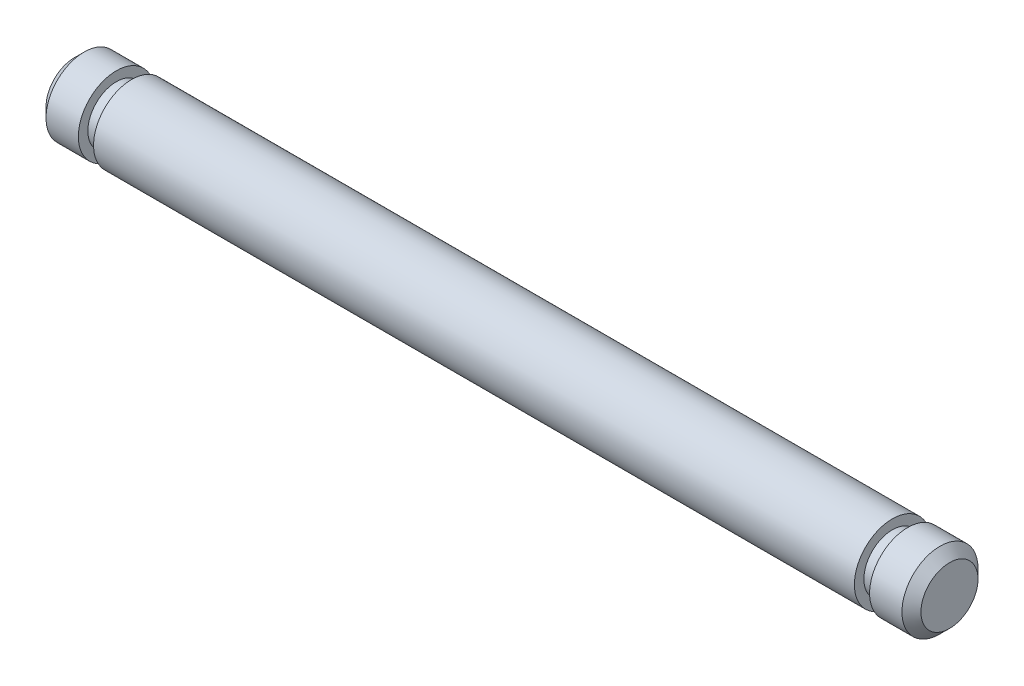
ISO-10303-21;
HEADER;
FILE_DESCRIPTION(('STEP AP214'),'2;1');
FILE_NAME('part.step','',(''),(''),'','','');
FILE_SCHEMA(('AUTOMOTIVE_DESIGN { 1 0 10303 214 1 1 1 1 }'));
ENDSEC;
DATA;
#1=APPLICATION_CONTEXT('core data for automotive mechanical design processes');
#2=APPLICATION_PROTOCOL_DEFINITION('international standard','automotive_design',2000,#1);
#3=PRODUCT_CONTEXT('',#1,'mechanical');
#4=PRODUCT('Part','Part','',(#3));
#5=PRODUCT_RELATED_PRODUCT_CATEGORY('part','',(#4));
#6=PRODUCT_DEFINITION_FORMATION('','',#4);
#7=PRODUCT_DEFINITION_CONTEXT('part definition',#1,'design');
#8=PRODUCT_DEFINITION('design','',#6,#7);
#9=PRODUCT_DEFINITION_SHAPE('','',#8);
#10=(LENGTH_UNIT() NAMED_UNIT(*) SI_UNIT(.MILLI.,.METRE.));
#11=(NAMED_UNIT(*) PLANE_ANGLE_UNIT() SI_UNIT($,.RADIAN.));
#12=(NAMED_UNIT(*) SI_UNIT($,.STERADIAN.) SOLID_ANGLE_UNIT());
#13=UNCERTAINTY_MEASURE_WITH_UNIT(LENGTH_MEASURE(1.E-05),#10,'distance_accuracy_value','');
#14=(GEOMETRIC_REPRESENTATION_CONTEXT(3) GLOBAL_UNCERTAINTY_ASSIGNED_CONTEXT((#13)) GLOBAL_UNIT_ASSIGNED_CONTEXT((#10,
#11,#12)) REPRESENTATION_CONTEXT('',''));
#15=CARTESIAN_POINT('',(0.,0.,0.));
#16=DIRECTION('',(0.,0.,1.));
#17=DIRECTION('',(1.,0.,0.));
#18=AXIS2_PLACEMENT_3D('',#15,#16,#17);
#19=CARTESIAN_POINT('',(23.,0.,0.));
#20=DIRECTION('',(-1.,0.,0.));
#21=DIRECTION('',(0.,0.,1.));
#22=AXIS2_PLACEMENT_3D('',#19,#20,#21);
#23=CYLINDRICAL_SURFACE('',#22,2.);
#24=CARTESIAN_POINT('',(20.,0.,0.));
#25=DIRECTION('',(1.,0.,0.));
#26=DIRECTION('',(0.,0.,-1.));
#27=AXIS2_PLACEMENT_3D('',#24,#25,#26);
#28=CIRCLE('',#27,2.);
#29=CARTESIAN_POINT('',(20.,0.,-2.));
#30=VERTEX_POINT('',#29);
#31=EDGE_CURVE('E62',#30,#30,#28,.T.);
#32=ORIENTED_EDGE('',*,*,#31,.F.);
#33=EDGE_LOOP('',(#32));
#34=FACE_BOUND('',#33,.T.);
#35=CARTESIAN_POINT('',(-20.,0.,0.));
#36=DIRECTION('',(1.,0.,0.));
#37=DIRECTION('',(0.,0.,-1.));
#38=AXIS2_PLACEMENT_3D('',#35,#36,#37);
#39=CIRCLE('',#38,2.);
#40=CARTESIAN_POINT('',(-20.,0.,-2.));
#41=VERTEX_POINT('',#40);
#42=EDGE_CURVE('E78',#41,#41,#39,.T.);
#43=ORIENTED_EDGE('',*,*,#42,.T.);
#44=EDGE_LOOP('',(#43));
#45=FACE_BOUND('',#44,.T.);
#46=ADVANCED_FACE('F37',(#34,#45),#23,.T.);
#47=CARTESIAN_POINT('',(20.8,0.,0.));
#48=DIRECTION('',(1.,0.,0.));
#49=DIRECTION('',(0.,0.,-1.));
#50=AXIS2_PLACEMENT_3D('',#47,#48,#49);
#51=CIRCLE('',#50,2.);
#52=CARTESIAN_POINT('',(20.8,0.,-2.));
#53=VERTEX_POINT('',#52);
#54=EDGE_CURVE('E61',#53,#53,#51,.T.);
#55=ORIENTED_EDGE('',*,*,#54,.T.);
#56=EDGE_LOOP('',(#55));
#57=FACE_BOUND('',#56,.T.);
#58=CARTESIAN_POINT('',(22.5,0.,0.));
#59=DIRECTION('',(1.,0.,0.));
#60=DIRECTION('',(0.,0.,-1.));
#61=AXIS2_PLACEMENT_3D('',#58,#59,#60);
#62=CIRCLE('',#61,2.);
#63=CARTESIAN_POINT('',(22.5,0.,-2.));
#64=VERTEX_POINT('',#63);
#65=EDGE_CURVE('E45',#64,#64,#62,.F.);
#66=ORIENTED_EDGE('',*,*,#65,.T.);
#67=EDGE_LOOP('',(#66));
#68=FACE_BOUND('',#67,.T.);
#69=ADVANCED_FACE('F109',(#57,#68),#23,.T.);
#70=CARTESIAN_POINT('',(23.,0.,0.));
#71=DIRECTION('',(1.,0.,0.));
#72=DIRECTION('',(0.,0.,-1.));
#73=AXIS2_PLACEMENT_3D('',#70,#71,#72);
#74=PLANE('',#73);
#75=CARTESIAN_POINT('',(23.,0.,0.));
#76=DIRECTION('',(1.,0.,0.));
#77=DIRECTION('',(0.,0.,-1.));
#78=AXIS2_PLACEMENT_3D('',#75,#76,#77);
#79=CIRCLE('',#78,1.49999999999999);
#80=CARTESIAN_POINT('',(23.,0.,-1.49999999999999));
#81=VERTEX_POINT('',#80);
#82=EDGE_CURVE('E55',#81,#81,#79,.T.);
#83=ORIENTED_EDGE('',*,*,#82,.T.);
#84=EDGE_LOOP('',(#83));
#85=FACE_BOUND('',#84,.T.);
#86=ADVANCED_FACE('F124',(#85),#74,.T.);
#87=CARTESIAN_POINT('',(23.,0.,0.));
#88=DIRECTION('',(-1.,0.,0.));
#89=DIRECTION('',(0.,0.,1.));
#90=AXIS2_PLACEMENT_3D('',#87,#88,#89);
#91=CONICAL_SURFACE('',#90,1.49999999999999,0.785398163397453);
#92=ORIENTED_EDGE('',*,*,#65,.F.);
#93=EDGE_LOOP('',(#92));
#94=FACE_BOUND('',#93,.T.);
#95=ORIENTED_EDGE('',*,*,#82,.F.);
#96=EDGE_LOOP('',(#95));
#97=FACE_BOUND('',#96,.T.);
#98=ADVANCED_FACE('F129',(#94,#97),#91,.T.);
#99=CARTESIAN_POINT('',(20.8,0.,0.));
#100=DIRECTION('',(1.,0.,0.));
#101=DIRECTION('',(0.,0.,-1.));
#102=AXIS2_PLACEMENT_3D('',#99,#100,#101);
#103=PLANE('',#102);
#104=ORIENTED_EDGE('',*,*,#54,.F.);
#105=EDGE_LOOP('',(#104));
#106=FACE_BOUND('',#105,.T.);
#107=CARTESIAN_POINT('',(20.8,0.,0.));
#108=DIRECTION('',(1.,0.,0.));
#109=DIRECTION('',(0.,0.,-1.));
#110=AXIS2_PLACEMENT_3D('',#107,#108,#109);
#111=CIRCLE('',#110,1.5);
#112=CARTESIAN_POINT('',(20.8,0.,-1.5));
#113=VERTEX_POINT('',#112);
#114=EDGE_CURVE('E66',#113,#113,#111,.T.);
#115=ORIENTED_EDGE('',*,*,#114,.T.);
#116=EDGE_LOOP('',(#115));
#117=FACE_BOUND('',#116,.T.);
#118=ADVANCED_FACE('F131',(#106,#117),#103,.F.);
#119=CARTESIAN_POINT('',(20.,0.,0.));
#120=DIRECTION('',(1.,0.,0.));
#121=DIRECTION('',(0.,0.,-1.));
#122=AXIS2_PLACEMENT_3D('',#119,#120,#121);
#123=PLANE('',#122);
#124=ORIENTED_EDGE('',*,*,#31,.T.);
#125=EDGE_LOOP('',(#124));
#126=FACE_BOUND('',#125,.T.);
#127=CARTESIAN_POINT('',(20.,0.,0.));
#128=DIRECTION('',(1.,0.,0.));
#129=DIRECTION('',(0.,0.,-1.));
#130=AXIS2_PLACEMENT_3D('',#127,#128,#129);
#131=CIRCLE('',#130,1.5);
#132=CARTESIAN_POINT('',(20.,0.,-1.5));
#133=VERTEX_POINT('',#132);
#134=EDGE_CURVE('E70',#133,#133,#131,.T.);
#135=ORIENTED_EDGE('',*,*,#134,.F.);
#136=EDGE_LOOP('',(#135));
#137=FACE_BOUND('',#136,.T.);
#138=ADVANCED_FACE('F137',(#126,#137),#123,.T.);
#139=CARTESIAN_POINT('',(20.8,0.,0.));
#140=DIRECTION('',(-1.,0.,0.));
#141=DIRECTION('',(0.,0.,1.));
#142=AXIS2_PLACEMENT_3D('',#139,#140,#141);
#143=CYLINDRICAL_SURFACE('',#142,1.5);
#144=ORIENTED_EDGE('',*,*,#114,.F.);
#145=EDGE_LOOP('',(#144));
#146=FACE_BOUND('',#145,.T.);
#147=ORIENTED_EDGE('',*,*,#134,.T.);
#148=EDGE_LOOP('',(#147));
#149=FACE_BOUND('',#148,.T.);
#150=ADVANCED_FACE('F101',(#146,#149),#143,.T.);
#151=CARTESIAN_POINT('',(-20.8,0.,0.));
#152=DIRECTION('',(-1.,0.,0.));
#153=DIRECTION('',(0.,0.,-1.));
#154=AXIS2_PLACEMENT_3D('',#151,#152,#153);
#155=PLANE('',#154);
#156=CARTESIAN_POINT('',(-20.8,0.,0.));
#157=DIRECTION('',(1.,0.,0.));
#158=DIRECTION('',(0.,0.,-1.));
#159=AXIS2_PLACEMENT_3D('',#156,#157,#158);
#160=CIRCLE('',#159,1.5);
#161=CARTESIAN_POINT('',(-20.8,0.,-1.5));
#162=VERTEX_POINT('',#161);
#163=EDGE_CURVE('E82',#162,#162,#160,.T.);
#164=ORIENTED_EDGE('',*,*,#163,.F.);
#165=EDGE_LOOP('',(#164));
#166=FACE_BOUND('',#165,.T.);
#167=CARTESIAN_POINT('',(-20.8,0.,0.));
#168=DIRECTION('',(1.,0.,0.));
#169=DIRECTION('',(0.,0.,-1.));
#170=AXIS2_PLACEMENT_3D('',#167,#168,#169);
#171=CIRCLE('',#170,2.);
#172=CARTESIAN_POINT('',(-20.8,0.,-2.));
#173=VERTEX_POINT('',#172);
#174=EDGE_CURVE('E74',#173,#173,#171,.T.);
#175=ORIENTED_EDGE('',*,*,#174,.T.);
#176=EDGE_LOOP('',(#175));
#177=FACE_BOUND('',#176,.T.);
#178=ADVANCED_FACE('F97',(#166,#177),#155,.F.);
#179=CARTESIAN_POINT('',(-20.,0.,0.));
#180=DIRECTION('',(-1.,0.,0.));
#181=DIRECTION('',(0.,0.,-1.));
#182=AXIS2_PLACEMENT_3D('',#179,#180,#181);
#183=PLANE('',#182);
#184=CARTESIAN_POINT('',(-20.,0.,0.));
#185=DIRECTION('',(1.,0.,0.));
#186=DIRECTION('',(0.,0.,-1.));
#187=AXIS2_PLACEMENT_3D('',#184,#185,#186);
#188=CIRCLE('',#187,1.5);
#189=CARTESIAN_POINT('',(-20.,0.,-1.5));
#190=VERTEX_POINT('',#189);
#191=EDGE_CURVE('E86',#190,#190,#188,.T.);
#192=ORIENTED_EDGE('',*,*,#191,.T.);
#193=EDGE_LOOP('',(#192));
#194=FACE_BOUND('',#193,.T.);
#195=ORIENTED_EDGE('',*,*,#42,.F.);
#196=EDGE_LOOP('',(#195));
#197=FACE_BOUND('',#196,.T.);
#198=ADVANCED_FACE('F100',(#194,#197),#183,.T.);
#199=CARTESIAN_POINT('',(-20.8,0.,0.));
#200=DIRECTION('',(1.,0.,0.));
#201=DIRECTION('',(0.,0.,-1.));
#202=AXIS2_PLACEMENT_3D('',#199,#200,#201);
#203=CYLINDRICAL_SURFACE('',#202,1.5);
#204=ORIENTED_EDGE('',*,*,#163,.T.);
#205=EDGE_LOOP('',(#204));
#206=FACE_BOUND('',#205,.T.);
#207=ORIENTED_EDGE('',*,*,#191,.F.);
#208=EDGE_LOOP('',(#207));
#209=FACE_BOUND('',#208,.T.);
#210=ADVANCED_FACE('F94',(#206,#209),#203,.T.);
#211=CARTESIAN_POINT('',(-23.,0.,0.));
#212=DIRECTION('',(1.,0.,0.));
#213=DIRECTION('',(0.,0.,-1.));
#214=AXIS2_PLACEMENT_3D('',#211,#212,#213);
#215=PLANE('',#214);
#216=CARTESIAN_POINT('',(-23.,0.,0.));
#217=DIRECTION('',(1.,0.,0.));
#218=DIRECTION('',(0.,0.,-1.));
#219=AXIS2_PLACEMENT_3D('',#216,#217,#218);
#220=CIRCLE('',#219,1.5);
#221=CARTESIAN_POINT('',(-23.,0.,-1.5));
#222=VERTEX_POINT('',#221);
#223=EDGE_CURVE('E10',#222,#222,#220,.F.);
#224=ORIENTED_EDGE('',*,*,#223,.T.);
#225=EDGE_LOOP('',(#224));
#226=FACE_BOUND('',#225,.T.);
#227=ADVANCED_FACE('F113',(#226),#215,.F.);
#228=CARTESIAN_POINT('',(-22.5,0.,0.));
#229=DIRECTION('',(1.,0.,0.));
#230=DIRECTION('',(0.,0.,-1.));
#231=AXIS2_PLACEMENT_3D('',#228,#229,#230);
#232=CONICAL_SURFACE('',#231,2.,0.785398163397453);
#233=ORIENTED_EDGE('',*,*,#223,.F.);
#234=EDGE_LOOP('',(#233));
#235=FACE_BOUND('',#234,.T.);
#236=CARTESIAN_POINT('',(-22.5,0.,0.));
#237=DIRECTION('',(1.,0.,0.));
#238=DIRECTION('',(0.,0.,-1.));
#239=AXIS2_PLACEMENT_3D('',#236,#237,#238);
#240=CIRCLE('',#239,2.);
#241=CARTESIAN_POINT('',(-22.5,0.,-2.));
#242=VERTEX_POINT('',#241);
#243=EDGE_CURVE('E50',#242,#242,#240,.T.);
#244=ORIENTED_EDGE('',*,*,#243,.F.);
#245=EDGE_LOOP('',(#244));
#246=FACE_BOUND('',#245,.T.);
#247=ADVANCED_FACE('F39',(#235,#246),#232,.T.);
#248=ORIENTED_EDGE('',*,*,#174,.F.);
#249=EDGE_LOOP('',(#248));
#250=FACE_BOUND('',#249,.T.);
#251=ORIENTED_EDGE('',*,*,#243,.T.);
#252=EDGE_LOOP('',(#251));
#253=FACE_BOUND('',#252,.T.);
#254=ADVANCED_FACE('F105',(#250,#253),#23,.T.);
#255=CLOSED_SHELL('',(#46,#69,#86,#98,#118,#138,#150,#178,#198,#210,#227,#247,#254));
#256=MANIFOLD_SOLID_BREP('B2',#255);
#257=ADVANCED_BREP_SHAPE_REPRESENTATION('',(#18,#256),#14);
#258=SHAPE_DEFINITION_REPRESENTATION(#9,#257);
ENDSEC;
END-ISO-10303-21;
